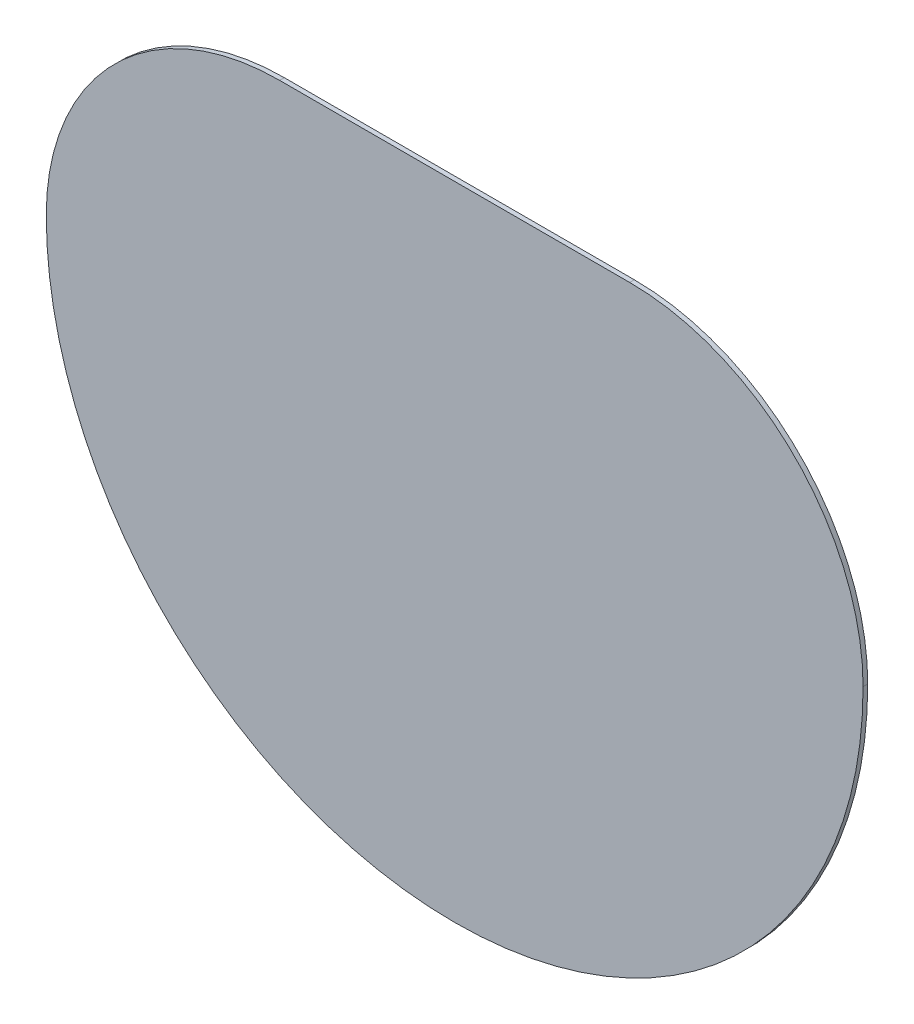
ISO-10303-21;
HEADER;
FILE_DESCRIPTION(('STEP AP214'),'2;1');
FILE_NAME('part.step','',(''),(''),'','','');
FILE_SCHEMA(('AUTOMOTIVE_DESIGN { 1 0 10303 214 1 1 1 1 }'));
ENDSEC;
DATA;
#1=APPLICATION_CONTEXT('core data for automotive mechanical design processes');
#2=APPLICATION_PROTOCOL_DEFINITION('international standard','automotive_design',2000,#1);
#3=PRODUCT_CONTEXT('',#1,'mechanical');
#4=PRODUCT('Part','Part','',(#3));
#5=PRODUCT_RELATED_PRODUCT_CATEGORY('part','',(#4));
#6=PRODUCT_DEFINITION_FORMATION('','',#4);
#7=PRODUCT_DEFINITION_CONTEXT('part definition',#1,'design');
#8=PRODUCT_DEFINITION('design','',#6,#7);
#9=PRODUCT_DEFINITION_SHAPE('','',#8);
#10=(LENGTH_UNIT() NAMED_UNIT(*) SI_UNIT(.MILLI.,.METRE.));
#11=(NAMED_UNIT(*) PLANE_ANGLE_UNIT() SI_UNIT($,.RADIAN.));
#12=(NAMED_UNIT(*) SI_UNIT($,.STERADIAN.) SOLID_ANGLE_UNIT());
#13=UNCERTAINTY_MEASURE_WITH_UNIT(LENGTH_MEASURE(1.E-05),#10,'distance_accuracy_value','');
#14=(GEOMETRIC_REPRESENTATION_CONTEXT(3) GLOBAL_UNCERTAINTY_ASSIGNED_CONTEXT((#13)) GLOBAL_UNIT_ASSIGNED_CONTEXT((#10,
#11,#12)) REPRESENTATION_CONTEXT('',''));
#15=CARTESIAN_POINT('',(0.,0.,0.));
#16=DIRECTION('',(0.,0.,1.));
#17=DIRECTION('',(1.,0.,0.));
#18=AXIS2_PLACEMENT_3D('',#15,#16,#17);
#19=CARTESIAN_POINT('',(300.,-46.,-17.));
#20=DIRECTION('',(0.,0.,1.));
#21=DIRECTION('',(1.,0.,0.));
#22=AXIS2_PLACEMENT_3D('',#19,#20,#21);
#23=CYLINDRICAL_SURFACE('',#22,175.);
#24=CARTESIAN_POINT('',(300.,-46.,-15.));
#25=DIRECTION('',(0.,0.,-1.));
#26=DIRECTION('',(-1.,0.,0.));
#27=AXIS2_PLACEMENT_3D('',#24,#25,#26);
#28=CIRCLE('',#27,175.);
#29=CARTESIAN_POINT('',(475.,-46.,-15.));
#30=VERTEX_POINT('',#29);
#31=CARTESIAN_POINT('',(125.,-46.,-15.));
#32=VERTEX_POINT('',#31);
#33=EDGE_CURVE('E96',#30,#32,#28,.T.);
#34=ORIENTED_EDGE('',*,*,#33,.T.);
#35=DIRECTION('',(0.,0.,1.));
#36=VECTOR('',#35,1.);
#37=CARTESIAN_POINT('',(125.,-46.,-17.));
#38=LINE('',#37,#36);
#39=CARTESIAN_POINT('',(125.,-46.,-17.));
#40=VERTEX_POINT('',#39);
#41=EDGE_CURVE('E49',#32,#40,#38,.F.);
#42=ORIENTED_EDGE('',*,*,#41,.T.);
#43=CARTESIAN_POINT('',(300.,-46.,-17.));
#44=DIRECTION('',(0.,0.,-1.));
#45=DIRECTION('',(-1.,0.,0.));
#46=AXIS2_PLACEMENT_3D('',#43,#44,#45);
#47=CIRCLE('',#46,175.);
#48=CARTESIAN_POINT('',(475.,-46.,-17.));
#49=VERTEX_POINT('',#48);
#50=EDGE_CURVE('E95',#49,#40,#47,.T.);
#51=ORIENTED_EDGE('',*,*,#50,.F.);
#52=DIRECTION('',(0.,0.,1.));
#53=VECTOR('',#52,1.);
#54=CARTESIAN_POINT('',(475.,-46.,-17.));
#55=LINE('',#54,#53);
#56=EDGE_CURVE('E82',#49,#30,#55,.T.);
#57=ORIENTED_EDGE('',*,*,#56,.T.);
#58=EDGE_LOOP('',(#34,#42,#51,#57));
#59=FACE_BOUND('',#58,.T.);
#60=ADVANCED_FACE('F34',(#59),#23,.T.);
#61=CARTESIAN_POINT('',(156.385933836549,54.,-17.));
#62=DIRECTION('',(0.,-1.,0.));
#63=DIRECTION('',(0.,0.,-1.));
#64=AXIS2_PLACEMENT_3D('',#61,#62,#63);
#65=PLANE('',#64);
#66=DIRECTION('',(1.,0.,0.));
#67=VECTOR('',#66,1.);
#68=CARTESIAN_POINT('',(156.385933836549,54.,-17.));
#69=LINE('',#68,#67);
#70=CARTESIAN_POINT('',(225.,54.,-17.));
#71=VERTEX_POINT('',#70);
#72=CARTESIAN_POINT('',(375.,54.,-17.));
#73=VERTEX_POINT('',#72);
#74=EDGE_CURVE('E91',#71,#73,#69,.T.);
#75=ORIENTED_EDGE('',*,*,#74,.F.);
#76=DIRECTION('',(0.,0.,1.));
#77=VECTOR('',#76,1.);
#78=CARTESIAN_POINT('',(225.,54.,-17.));
#79=LINE('',#78,#77);
#80=CARTESIAN_POINT('',(225.,54.,-15.));
#81=VERTEX_POINT('',#80);
#82=EDGE_CURVE('E78',#71,#81,#79,.T.);
#83=ORIENTED_EDGE('',*,*,#82,.T.);
#84=DIRECTION('',(1.,0.,0.));
#85=VECTOR('',#84,1.);
#86=CARTESIAN_POINT('',(156.385933836549,54.,-15.));
#87=LINE('',#86,#85);
#88=CARTESIAN_POINT('',(375.,54.,-15.));
#89=VERTEX_POINT('',#88);
#90=EDGE_CURVE('E89',#81,#89,#87,.T.);
#91=ORIENTED_EDGE('',*,*,#90,.T.);
#92=DIRECTION('',(0.,0.,1.));
#93=VECTOR('',#92,1.);
#94=CARTESIAN_POINT('',(375.,54.,-17.));
#95=LINE('',#94,#93);
#96=EDGE_CURVE('E92',#89,#73,#95,.F.);
#97=ORIENTED_EDGE('',*,*,#96,.T.);
#98=EDGE_LOOP('',(#75,#83,#91,#97));
#99=FACE_BOUND('',#98,.T.);
#100=ADVANCED_FACE('F88',(#99),#65,.F.);
#101=CARTESIAN_POINT('',(300.,-46.,-17.));
#102=DIRECTION('',(0.,0.,-1.));
#103=DIRECTION('',(-1.,0.,0.));
#104=AXIS2_PLACEMENT_3D('',#101,#102,#103);
#105=PLANE('',#104);
#106=ORIENTED_EDGE('',*,*,#50,.T.);
#107=CARTESIAN_POINT('',(225.,-46.,-17.));
#108=DIRECTION('',(0.,0.,-1.));
#109=DIRECTION('',(-1.,0.,0.));
#110=AXIS2_PLACEMENT_3D('',#107,#108,#109);
#111=CIRCLE('',#110,100.);
#112=EDGE_CURVE('E11',#40,#71,#111,.T.);
#113=ORIENTED_EDGE('',*,*,#112,.T.);
#114=ORIENTED_EDGE('',*,*,#74,.T.);
#115=CARTESIAN_POINT('',(375.,-46.,-17.));
#116=DIRECTION('',(0.,0.,-1.));
#117=DIRECTION('',(-1.,0.,0.));
#118=AXIS2_PLACEMENT_3D('',#115,#116,#117);
#119=CIRCLE('',#118,100.);
#120=EDGE_CURVE('E42',#73,#49,#119,.T.);
#121=ORIENTED_EDGE('',*,*,#120,.T.);
#122=EDGE_LOOP('',(#106,#113,#114,#121));
#123=FACE_BOUND('',#122,.T.);
#124=ADVANCED_FACE('F108',(#123),#105,.T.);
#125=CARTESIAN_POINT('',(300.,-46.,-15.));
#126=DIRECTION('',(0.,0.,-1.));
#127=DIRECTION('',(-1.,0.,0.));
#128=AXIS2_PLACEMENT_3D('',#125,#126,#127);
#129=PLANE('',#128);
#130=ORIENTED_EDGE('',*,*,#90,.F.);
#131=CARTESIAN_POINT('',(225.,-46.,-15.));
#132=DIRECTION('',(0.,0.,-1.));
#133=DIRECTION('',(-1.,0.,0.));
#134=AXIS2_PLACEMENT_3D('',#131,#132,#133);
#135=CIRCLE('',#134,100.);
#136=EDGE_CURVE('E74',#81,#32,#135,.F.);
#137=ORIENTED_EDGE('',*,*,#136,.T.);
#138=ORIENTED_EDGE('',*,*,#33,.F.);
#139=CARTESIAN_POINT('',(375.,-46.,-15.));
#140=DIRECTION('',(0.,0.,-1.));
#141=DIRECTION('',(-1.,0.,0.));
#142=AXIS2_PLACEMENT_3D('',#139,#140,#141);
#143=CIRCLE('',#142,100.);
#144=EDGE_CURVE('E83',#30,#89,#143,.F.);
#145=ORIENTED_EDGE('',*,*,#144,.T.);
#146=EDGE_LOOP('',(#130,#137,#138,#145));
#147=FACE_BOUND('',#146,.T.);
#148=ADVANCED_FACE('F94',(#147),#129,.F.);
#149=CARTESIAN_POINT('',(225.,-46.,-17.));
#150=DIRECTION('',(0.,0.,1.));
#151=DIRECTION('',(1.,0.,0.));
#152=AXIS2_PLACEMENT_3D('',#149,#150,#151);
#153=CYLINDRICAL_SURFACE('',#152,100.);
#154=ORIENTED_EDGE('',*,*,#112,.F.);
#155=ORIENTED_EDGE('',*,*,#41,.F.);
#156=ORIENTED_EDGE('',*,*,#136,.F.);
#157=ORIENTED_EDGE('',*,*,#82,.F.);
#158=EDGE_LOOP('',(#154,#155,#156,#157));
#159=FACE_BOUND('',#158,.T.);
#160=ADVANCED_FACE('F77',(#159),#153,.T.);
#161=CARTESIAN_POINT('',(375.,-46.,-17.));
#162=DIRECTION('',(0.,0.,1.));
#163=DIRECTION('',(1.,0.,0.));
#164=AXIS2_PLACEMENT_3D('',#161,#162,#163);
#165=CYLINDRICAL_SURFACE('',#164,100.);
#166=ORIENTED_EDGE('',*,*,#120,.F.);
#167=ORIENTED_EDGE('',*,*,#96,.F.);
#168=ORIENTED_EDGE('',*,*,#144,.F.);
#169=ORIENTED_EDGE('',*,*,#56,.F.);
#170=EDGE_LOOP('',(#166,#167,#168,#169));
#171=FACE_BOUND('',#170,.T.);
#172=ADVANCED_FACE('F36',(#171),#165,.T.);
#173=CLOSED_SHELL('',(#60,#100,#124,#148,#160,#172));
#174=MANIFOLD_SOLID_BREP('B2',#173);
#175=ADVANCED_BREP_SHAPE_REPRESENTATION('',(#18,#174),#14);
#176=SHAPE_DEFINITION_REPRESENTATION(#9,#175);
ENDSEC;
END-ISO-10303-21;
